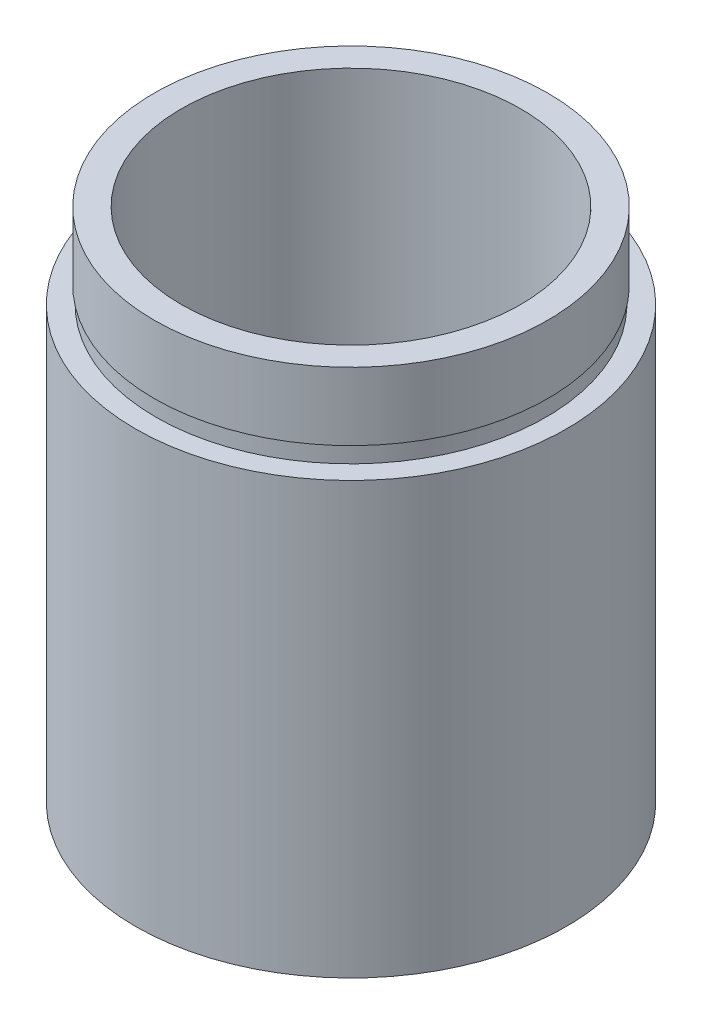
ISO-10303-21;
HEADER;
FILE_DESCRIPTION(('STEP AP214'),'2;1');
FILE_NAME('part.step','',(''),(''),'','','');
FILE_SCHEMA(('AUTOMOTIVE_DESIGN { 1 0 10303 214 1 1 1 1 }'));
ENDSEC;
DATA;
#1=APPLICATION_CONTEXT('core data for automotive mechanical design processes');
#2=APPLICATION_PROTOCOL_DEFINITION('international standard','automotive_design',2000,#1);
#3=PRODUCT_CONTEXT('',#1,'mechanical');
#4=PRODUCT('Part','Part','',(#3));
#5=PRODUCT_RELATED_PRODUCT_CATEGORY('part','',(#4));
#6=PRODUCT_DEFINITION_FORMATION('','',#4);
#7=PRODUCT_DEFINITION_CONTEXT('part definition',#1,'design');
#8=PRODUCT_DEFINITION('design','',#6,#7);
#9=PRODUCT_DEFINITION_SHAPE('','',#8);
#10=(LENGTH_UNIT() NAMED_UNIT(*) SI_UNIT(.MILLI.,.METRE.));
#11=(NAMED_UNIT(*) PLANE_ANGLE_UNIT() SI_UNIT($,.RADIAN.));
#12=(NAMED_UNIT(*) SI_UNIT($,.STERADIAN.) SOLID_ANGLE_UNIT());
#13=UNCERTAINTY_MEASURE_WITH_UNIT(LENGTH_MEASURE(1.E-05),#10,'distance_accuracy_value','');
#14=(GEOMETRIC_REPRESENTATION_CONTEXT(3) GLOBAL_UNCERTAINTY_ASSIGNED_CONTEXT((#13)) GLOBAL_UNIT_ASSIGNED_CONTEXT((#10,
#11,#12)) REPRESENTATION_CONTEXT('',''));
#15=CARTESIAN_POINT('',(0.,0.,0.));
#16=DIRECTION('',(0.,0.,1.));
#17=DIRECTION('',(1.,0.,0.));
#18=AXIS2_PLACEMENT_3D('',#15,#16,#17);
#19=CARTESIAN_POINT('',(11.1,0.,0.));
#20=DIRECTION('',(0.,1.,0.));
#21=DIRECTION('',(0.,0.,1.));
#22=AXIS2_PLACEMENT_3D('',#19,#20,#21);
#23=PLANE('',#22);
#24=CARTESIAN_POINT('',(0.,0.,0.));
#25=DIRECTION('',(0.,1.,0.));
#26=DIRECTION('',(0.,0.,1.));
#27=AXIS2_PLACEMENT_3D('',#24,#25,#26);
#28=CIRCLE('',#27,12.7);
#29=CARTESIAN_POINT('',(0.,0.,12.7));
#30=VERTEX_POINT('',#29);
#31=EDGE_CURVE('E10',#30,#30,#28,.T.);
#32=ORIENTED_EDGE('',*,*,#31,.F.);
#33=EDGE_LOOP('',(#32));
#34=FACE_BOUND('',#33,.T.);
#35=CARTESIAN_POINT('',(0.,0.,0.));
#36=DIRECTION('',(0.,1.,0.));
#37=DIRECTION('',(0.,0.,1.));
#38=AXIS2_PLACEMENT_3D('',#35,#36,#37);
#39=CIRCLE('',#38,11.1);
#40=CARTESIAN_POINT('',(0.,0.,11.1));
#41=VERTEX_POINT('',#40);
#42=EDGE_CURVE('E77',#41,#41,#39,.T.);
#43=ORIENTED_EDGE('',*,*,#42,.T.);
#44=EDGE_LOOP('',(#43));
#45=FACE_BOUND('',#44,.T.);
#46=ADVANCED_FACE('F37',(#34,#45),#23,.F.);
#47=CARTESIAN_POINT('',(0.,161.376166943427,0.));
#48=DIRECTION('',(0.,1.,0.));
#49=DIRECTION('',(0.,0.,1.));
#50=AXIS2_PLACEMENT_3D('',#47,#48,#49);
#51=CYLINDRICAL_SURFACE('',#50,12.7);
#52=CARTESIAN_POINT('',(0.,25.4,0.));
#53=DIRECTION('',(0.,1.,0.));
#54=DIRECTION('',(0.,0.,1.));
#55=AXIS2_PLACEMENT_3D('',#52,#53,#54);
#56=CIRCLE('',#55,12.7);
#57=CARTESIAN_POINT('',(0.,25.4,12.7));
#58=VERTEX_POINT('',#57);
#59=EDGE_CURVE('E43',#58,#58,#56,.T.);
#60=ORIENTED_EDGE('',*,*,#59,.F.);
#61=EDGE_LOOP('',(#60));
#62=FACE_BOUND('',#61,.T.);
#63=ORIENTED_EDGE('',*,*,#31,.T.);
#64=EDGE_LOOP('',(#63));
#65=FACE_BOUND('',#64,.T.);
#66=ADVANCED_FACE('F138',(#62,#65),#51,.T.);
#67=CARTESIAN_POINT('',(12.7,25.4,0.));
#68=DIRECTION('',(0.,-1.,0.));
#69=DIRECTION('',(0.,0.,-1.));
#70=AXIS2_PLACEMENT_3D('',#67,#68,#69);
#71=PLANE('',#70);
#72=CARTESIAN_POINT('',(0.,25.4,0.));
#73=DIRECTION('',(0.,1.,0.));
#74=DIRECTION('',(0.,0.,1.));
#75=AXIS2_PLACEMENT_3D('',#72,#73,#74);
#76=CIRCLE('',#75,11.5);
#77=CARTESIAN_POINT('',(0.,25.4,11.5));
#78=VERTEX_POINT('',#77);
#79=EDGE_CURVE('E47',#78,#78,#76,.T.);
#80=ORIENTED_EDGE('',*,*,#79,.F.);
#81=EDGE_LOOP('',(#80));
#82=FACE_BOUND('',#81,.T.);
#83=ORIENTED_EDGE('',*,*,#59,.T.);
#84=EDGE_LOOP('',(#83));
#85=FACE_BOUND('',#84,.T.);
#86=ADVANCED_FACE('F133',(#82,#85),#71,.F.);
#87=CARTESIAN_POINT('',(0.,161.376166943427,0.));
#88=DIRECTION('',(0.,1.,0.));
#89=DIRECTION('',(0.,0.,1.));
#90=AXIS2_PLACEMENT_3D('',#87,#88,#89);
#91=CYLINDRICAL_SURFACE('',#90,11.5);
#92=CARTESIAN_POINT('',(0.,26.4,0.));
#93=DIRECTION('',(0.,1.,0.));
#94=DIRECTION('',(0.,0.,1.));
#95=AXIS2_PLACEMENT_3D('',#92,#93,#94);
#96=CIRCLE('',#95,11.5);
#97=CARTESIAN_POINT('',(0.,26.4,11.5));
#98=VERTEX_POINT('',#97);
#99=EDGE_CURVE('E51',#98,#98,#96,.T.);
#100=ORIENTED_EDGE('',*,*,#99,.F.);
#101=EDGE_LOOP('',(#100));
#102=FACE_BOUND('',#101,.T.);
#103=ORIENTED_EDGE('',*,*,#79,.T.);
#104=EDGE_LOOP('',(#103));
#105=FACE_BOUND('',#104,.T.);
#106=ADVANCED_FACE('F127',(#102,#105),#91,.T.);
#107=CARTESIAN_POINT('',(11.5,26.4,0.));
#108=DIRECTION('',(0.,1.,0.));
#109=DIRECTION('',(0.,0.,1.));
#110=AXIS2_PLACEMENT_3D('',#107,#108,#109);
#111=PLANE('',#110);
#112=CARTESIAN_POINT('',(0.,26.4,0.));
#113=DIRECTION('',(0.,1.,0.));
#114=DIRECTION('',(0.,0.,1.));
#115=AXIS2_PLACEMENT_3D('',#112,#113,#114);
#116=CIRCLE('',#115,11.6);
#117=CARTESIAN_POINT('',(0.,26.4,11.6));
#118=VERTEX_POINT('',#117);
#119=EDGE_CURVE('E56',#118,#118,#116,.T.);
#120=ORIENTED_EDGE('',*,*,#119,.F.);
#121=EDGE_LOOP('',(#120));
#122=FACE_BOUND('',#121,.T.);
#123=ORIENTED_EDGE('',*,*,#99,.T.);
#124=EDGE_LOOP('',(#123));
#125=FACE_BOUND('',#124,.T.);
#126=ADVANCED_FACE('F121',(#122,#125),#111,.F.);
#127=CARTESIAN_POINT('',(0.,161.376166943427,0.));
#128=DIRECTION('',(0.,1.,0.));
#129=DIRECTION('',(0.,0.,1.));
#130=AXIS2_PLACEMENT_3D('',#127,#128,#129);
#131=CYLINDRICAL_SURFACE('',#130,11.6);
#132=CARTESIAN_POINT('',(0.,30.4,0.));
#133=DIRECTION('',(0.,1.,0.));
#134=DIRECTION('',(0.,0.,1.));
#135=AXIS2_PLACEMENT_3D('',#132,#133,#134);
#136=CIRCLE('',#135,11.6);
#137=CARTESIAN_POINT('',(0.,30.4,11.6));
#138=VERTEX_POINT('',#137);
#139=EDGE_CURVE('E59',#138,#138,#136,.T.);
#140=ORIENTED_EDGE('',*,*,#139,.F.);
#141=EDGE_LOOP('',(#140));
#142=FACE_BOUND('',#141,.T.);
#143=ORIENTED_EDGE('',*,*,#119,.T.);
#144=EDGE_LOOP('',(#143));
#145=FACE_BOUND('',#144,.T.);
#146=ADVANCED_FACE('F115',(#142,#145),#131,.T.);
#147=CARTESIAN_POINT('',(11.6,30.4,0.));
#148=DIRECTION('',(0.,-1.,0.));
#149=DIRECTION('',(0.,0.,-1.));
#150=AXIS2_PLACEMENT_3D('',#147,#148,#149);
#151=PLANE('',#150);
#152=CARTESIAN_POINT('',(0.,30.4,0.));
#153=DIRECTION('',(0.,1.,0.));
#154=DIRECTION('',(0.,0.,1.));
#155=AXIS2_PLACEMENT_3D('',#152,#153,#154);
#156=CIRCLE('',#155,10.);
#157=CARTESIAN_POINT('',(0.,30.4,10.));
#158=VERTEX_POINT('',#157);
#159=EDGE_CURVE('E62',#158,#158,#156,.T.);
#160=ORIENTED_EDGE('',*,*,#159,.F.);
#161=EDGE_LOOP('',(#160));
#162=FACE_BOUND('',#161,.T.);
#163=ORIENTED_EDGE('',*,*,#139,.T.);
#164=EDGE_LOOP('',(#163));
#165=FACE_BOUND('',#164,.T.);
#166=ADVANCED_FACE('F109',(#162,#165),#151,.F.);
#167=CARTESIAN_POINT('',(0.,161.376166943427,0.));
#168=DIRECTION('',(0.,1.,0.));
#169=DIRECTION('',(0.,0.,1.));
#170=AXIS2_PLACEMENT_3D('',#167,#168,#169);
#171=CYLINDRICAL_SURFACE('',#170,10.);
#172=CARTESIAN_POINT('',(0.,5.49999999999998,0.));
#173=DIRECTION('',(0.,1.,0.));
#174=DIRECTION('',(0.,0.,1.));
#175=AXIS2_PLACEMENT_3D('',#172,#173,#174);
#176=CIRCLE('',#175,10.);
#177=CARTESIAN_POINT('',(0.,5.49999999999998,10.));
#178=VERTEX_POINT('',#177);
#179=EDGE_CURVE('E65',#178,#178,#176,.T.);
#180=ORIENTED_EDGE('',*,*,#179,.F.);
#181=EDGE_LOOP('',(#180));
#182=FACE_BOUND('',#181,.T.);
#183=ORIENTED_EDGE('',*,*,#159,.T.);
#184=EDGE_LOOP('',(#183));
#185=FACE_BOUND('',#184,.T.);
#186=ADVANCED_FACE('F103',(#182,#185),#171,.F.);
#187=CARTESIAN_POINT('',(11.7,5.49999999999998,0.));
#188=DIRECTION('',(0.,1.,0.));
#189=DIRECTION('',(0.,0.,1.));
#190=AXIS2_PLACEMENT_3D('',#187,#188,#189);
#191=PLANE('',#190);
#192=CARTESIAN_POINT('',(0.,5.49999999999998,0.));
#193=DIRECTION('',(0.,1.,0.));
#194=DIRECTION('',(0.,0.,1.));
#195=AXIS2_PLACEMENT_3D('',#192,#193,#194);
#196=CIRCLE('',#195,11.7);
#197=CARTESIAN_POINT('',(0.,5.49999999999998,11.7));
#198=VERTEX_POINT('',#197);
#199=EDGE_CURVE('E68',#198,#198,#196,.T.);
#200=ORIENTED_EDGE('',*,*,#199,.F.);
#201=EDGE_LOOP('',(#200));
#202=FACE_BOUND('',#201,.T.);
#203=ORIENTED_EDGE('',*,*,#179,.T.);
#204=EDGE_LOOP('',(#203));
#205=FACE_BOUND('',#204,.T.);
#206=ADVANCED_FACE('F97',(#202,#205),#191,.F.);
#207=CARTESIAN_POINT('',(0.,161.376166943427,0.));
#208=DIRECTION('',(0.,1.,0.));
#209=DIRECTION('',(0.,0.,1.));
#210=AXIS2_PLACEMENT_3D('',#207,#208,#209);
#211=CYLINDRICAL_SURFACE('',#210,11.7);
#212=CARTESIAN_POINT('',(0.,4.49999999999998,0.));
#213=DIRECTION('',(0.,1.,0.));
#214=DIRECTION('',(0.,0.,1.));
#215=AXIS2_PLACEMENT_3D('',#212,#213,#214);
#216=CIRCLE('',#215,11.7);
#217=CARTESIAN_POINT('',(0.,4.49999999999998,11.7));
#218=VERTEX_POINT('',#217);
#219=EDGE_CURVE('E71',#218,#218,#216,.T.);
#220=ORIENTED_EDGE('',*,*,#219,.F.);
#221=EDGE_LOOP('',(#220));
#222=FACE_BOUND('',#221,.T.);
#223=ORIENTED_EDGE('',*,*,#199,.T.);
#224=EDGE_LOOP('',(#223));
#225=FACE_BOUND('',#224,.T.);
#226=ADVANCED_FACE('F91',(#222,#225),#211,.F.);
#227=CARTESIAN_POINT('',(11.1,4.49999999999998,0.));
#228=DIRECTION('',(0.,-1.,0.));
#229=DIRECTION('',(0.,0.,-1.));
#230=AXIS2_PLACEMENT_3D('',#227,#228,#229);
#231=PLANE('',#230);
#232=CARTESIAN_POINT('',(0.,4.49999999999998,0.));
#233=DIRECTION('',(0.,1.,0.));
#234=DIRECTION('',(0.,0.,1.));
#235=AXIS2_PLACEMENT_3D('',#232,#233,#234);
#236=CIRCLE('',#235,11.1);
#237=CARTESIAN_POINT('',(0.,4.49999999999998,11.1));
#238=VERTEX_POINT('',#237);
#239=EDGE_CURVE('E74',#238,#238,#236,.T.);
#240=ORIENTED_EDGE('',*,*,#239,.F.);
#241=EDGE_LOOP('',(#240));
#242=FACE_BOUND('',#241,.T.);
#243=ORIENTED_EDGE('',*,*,#219,.T.);
#244=EDGE_LOOP('',(#243));
#245=FACE_BOUND('',#244,.T.);
#246=ADVANCED_FACE('F85',(#242,#245),#231,.F.);
#247=CARTESIAN_POINT('',(0.,161.376166943427,0.));
#248=DIRECTION('',(0.,1.,0.));
#249=DIRECTION('',(0.,0.,1.));
#250=AXIS2_PLACEMENT_3D('',#247,#248,#249);
#251=CYLINDRICAL_SURFACE('',#250,11.1);
#252=ORIENTED_EDGE('',*,*,#42,.F.);
#253=EDGE_LOOP('',(#252));
#254=FACE_BOUND('',#253,.T.);
#255=ORIENTED_EDGE('',*,*,#239,.T.);
#256=EDGE_LOOP('',(#255));
#257=FACE_BOUND('',#256,.T.);
#258=ADVANCED_FACE('F82',(#254,#257),#251,.F.);
#259=CLOSED_SHELL('',(#46,#66,#86,#106,#126,#146,#166,#186,#206,#226,#246,#258));
#260=MANIFOLD_SOLID_BREP('B2',#259);
#261=ADVANCED_BREP_SHAPE_REPRESENTATION('',(#18,#260),#14);
#262=SHAPE_DEFINITION_REPRESENTATION(#9,#261);
ENDSEC;
END-ISO-10303-21;
